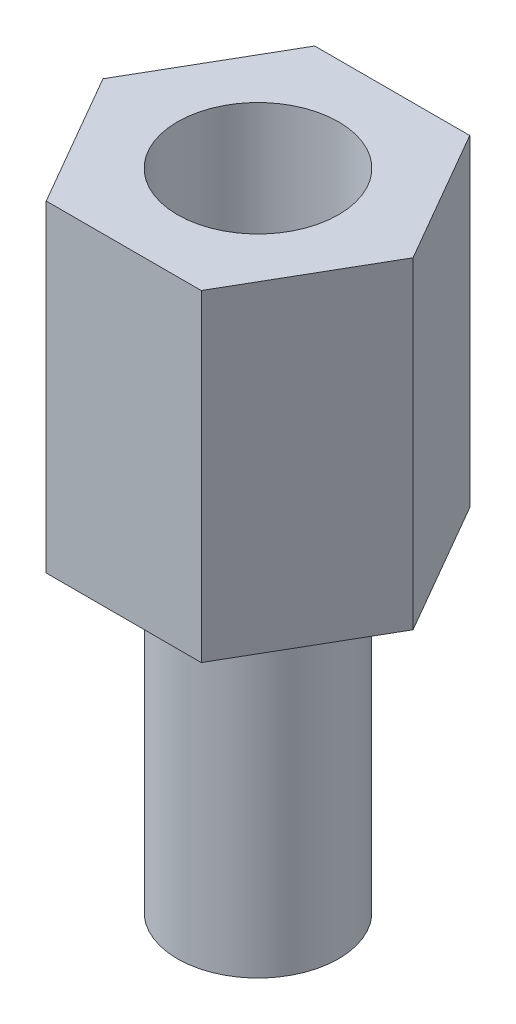
ISO-10303-21;
HEADER;
FILE_DESCRIPTION(('STEP AP214'),'2;1');
FILE_NAME('part.step','',(''),(''),'','','');
FILE_SCHEMA(('AUTOMOTIVE_DESIGN { 1 0 10303 214 1 1 1 1 }'));
ENDSEC;
DATA;
#1=APPLICATION_CONTEXT('core data for automotive mechanical design processes');
#2=APPLICATION_PROTOCOL_DEFINITION('international standard','automotive_design',2000,#1);
#3=PRODUCT_CONTEXT('',#1,'mechanical');
#4=PRODUCT('Part','Part','',(#3));
#5=PRODUCT_RELATED_PRODUCT_CATEGORY('part','',(#4));
#6=PRODUCT_DEFINITION_FORMATION('','',#4);
#7=PRODUCT_DEFINITION_CONTEXT('part definition',#1,'design');
#8=PRODUCT_DEFINITION('design','',#6,#7);
#9=PRODUCT_DEFINITION_SHAPE('','',#8);
#10=(LENGTH_UNIT() NAMED_UNIT(*) SI_UNIT(.MILLI.,.METRE.));
#11=(NAMED_UNIT(*) PLANE_ANGLE_UNIT() SI_UNIT($,.RADIAN.));
#12=(NAMED_UNIT(*) SI_UNIT($,.STERADIAN.) SOLID_ANGLE_UNIT());
#13=UNCERTAINTY_MEASURE_WITH_UNIT(LENGTH_MEASURE(1.E-05),#10,'distance_accuracy_value','');
#14=(GEOMETRIC_REPRESENTATION_CONTEXT(3) GLOBAL_UNCERTAINTY_ASSIGNED_CONTEXT((#13)) GLOBAL_UNIT_ASSIGNED_CONTEXT((#10,
#11,#12)) REPRESENTATION_CONTEXT('',''));
#15=CARTESIAN_POINT('',(0.,0.,0.));
#16=DIRECTION('',(0.,0.,1.));
#17=DIRECTION('',(1.,0.,0.));
#18=AXIS2_PLACEMENT_3D('',#15,#16,#17);
#19=CARTESIAN_POINT('',(0.,-6.,0.));
#20=DIRECTION('',(0.,1.,0.));
#21=DIRECTION('',(0.,0.,1.));
#22=AXIS2_PLACEMENT_3D('',#19,#20,#21);
#23=CYLINDRICAL_SURFACE('',#22,1.5);
#24=CARTESIAN_POINT('',(0.,-6.,0.));
#25=DIRECTION('',(0.,-1.,0.));
#26=DIRECTION('',(0.,0.,-1.));
#27=AXIS2_PLACEMENT_3D('',#24,#25,#26);
#28=CIRCLE('',#27,1.5);
#29=CARTESIAN_POINT('',(0.,-6.,-1.5));
#30=VERTEX_POINT('',#29);
#31=EDGE_CURVE('E11',#30,#30,#28,.T.);
#32=ORIENTED_EDGE('',*,*,#31,.F.);
#33=EDGE_LOOP('',(#32));
#34=FACE_BOUND('',#33,.T.);
#35=CARTESIAN_POINT('',(0.,0.,0.));
#36=DIRECTION('',(0.,-1.,0.));
#37=DIRECTION('',(0.,0.,-1.));
#38=AXIS2_PLACEMENT_3D('',#35,#36,#37);
#39=CIRCLE('',#38,1.5);
#40=CARTESIAN_POINT('',(0.,0.,-1.5));
#41=VERTEX_POINT('',#40);
#42=EDGE_CURVE('E44',#41,#41,#39,.T.);
#43=ORIENTED_EDGE('',*,*,#42,.T.);
#44=EDGE_LOOP('',(#43));
#45=FACE_BOUND('',#44,.T.);
#46=ADVANCED_FACE('F41',(#34,#45),#23,.T.);
#47=CARTESIAN_POINT('',(0.,-6.,0.));
#48=DIRECTION('',(0.,-1.,0.));
#49=DIRECTION('',(0.,0.,-1.));
#50=AXIS2_PLACEMENT_3D('',#47,#48,#49);
#51=PLANE('',#50);
#52=ORIENTED_EDGE('',*,*,#31,.T.);
#53=EDGE_LOOP('',(#52));
#54=FACE_BOUND('',#53,.T.);
#55=ADVANCED_FACE('F56',(#54),#51,.T.);
#56=CARTESIAN_POINT('',(0.,0.,0.));
#57=DIRECTION('',(0.,-1.,0.));
#58=DIRECTION('',(0.,0.,-1.));
#59=AXIS2_PLACEMENT_3D('',#56,#57,#58);
#60=PLANE('',#59);
#61=ORIENTED_EDGE('',*,*,#42,.F.);
#62=EDGE_LOOP('',(#61));
#63=FACE_BOUND('',#62,.T.);
#64=ADVANCED_FACE('F54',(#63),#60,.F.);
#65=CLOSED_SHELL('',(#46,#55,#64));
#66=MANIFOLD_SOLID_BREP('B2',#65);
#67=CARTESIAN_POINT('',(0.,6.,0.));
#68=DIRECTION('',(0.,1.,0.));
#69=DIRECTION('',(0.,0.,1.));
#70=AXIS2_PLACEMENT_3D('',#67,#68,#69);
#71=PLANE('',#70);
#72=DIRECTION('',(1.,0.,0.));
#73=VECTOR('',#72,1.);
#74=CARTESIAN_POINT('',(-1.44337567297405,6.,2.5));
#75=LINE('',#74,#73);
#76=CARTESIAN_POINT('',(-1.44337567297405,6.,2.5));
#77=VERTEX_POINT('',#76);
#78=CARTESIAN_POINT('',(1.44337567297408,6.,2.5));
#79=VERTEX_POINT('',#78);
#80=EDGE_CURVE('E178',#77,#79,#75,.T.);
#81=ORIENTED_EDGE('',*,*,#80,.T.);
#82=DIRECTION('',(0.500000000000001,0.,-0.866025403784438));
#83=VECTOR('',#82,1.);
#84=CARTESIAN_POINT('',(1.44337567297408,6.,2.5));
#85=LINE('',#84,#83);
#86=CARTESIAN_POINT('',(2.88675134594815,6.,0.));
#87=VERTEX_POINT('',#86);
#88=EDGE_CURVE('E136',#79,#87,#85,.T.);
#89=ORIENTED_EDGE('',*,*,#88,.T.);
#90=DIRECTION('',(-0.500000000000001,0.,-0.866025403784438));
#91=VECTOR('',#90,1.);
#92=CARTESIAN_POINT('',(2.88675134594815,6.,0.));
#93=LINE('',#92,#91);
#94=CARTESIAN_POINT('',(1.44337567297408,6.,-2.50000000000001));
#95=VERTEX_POINT('',#94);
#96=EDGE_CURVE('E149',#87,#95,#93,.T.);
#97=ORIENTED_EDGE('',*,*,#96,.T.);
#98=DIRECTION('',(-1.,0.,0.));
#99=VECTOR('',#98,1.);
#100=CARTESIAN_POINT('',(1.44337567297408,6.,-2.50000000000001));
#101=LINE('',#100,#99);
#102=CARTESIAN_POINT('',(-1.44337567297405,6.,-2.50000000000001));
#103=VERTEX_POINT('',#102);
#104=EDGE_CURVE('E143',#95,#103,#101,.T.);
#105=ORIENTED_EDGE('',*,*,#104,.T.);
#106=DIRECTION('',(-0.5,0.,0.866025403784438));
#107=VECTOR('',#106,1.);
#108=CARTESIAN_POINT('',(-1.44337567297405,6.,-2.50000000000001));
#109=LINE('',#108,#107);
#110=CARTESIAN_POINT('',(-2.88675134594812,6.,0.));
#111=VERTEX_POINT('',#110);
#112=EDGE_CURVE('E147',#103,#111,#109,.T.);
#113=ORIENTED_EDGE('',*,*,#112,.T.);
#114=DIRECTION('',(0.5,0.,0.866025403784438));
#115=VECTOR('',#114,1.);
#116=CARTESIAN_POINT('',(-2.88675134594812,6.,0.));
#117=LINE('',#116,#115);
#118=EDGE_CURVE('E99',#111,#77,#117,.T.);
#119=ORIENTED_EDGE('',*,*,#118,.T.);
#120=EDGE_LOOP('',(#81,#89,#97,#105,#113,#119));
#121=FACE_BOUND('',#120,.T.);
#122=CARTESIAN_POINT('',(0.,6.,0.));
#123=DIRECTION('',(0.,1.,0.));
#124=DIRECTION('',(0.,0.,1.));
#125=AXIS2_PLACEMENT_3D('',#122,#123,#124);
#126=CIRCLE('',#125,1.5);
#127=CARTESIAN_POINT('',(0.,6.,1.5));
#128=VERTEX_POINT('',#127);
#129=EDGE_CURVE('E171',#128,#128,#126,.T.);
#130=ORIENTED_EDGE('',*,*,#129,.F.);
#131=EDGE_LOOP('',(#130));
#132=FACE_BOUND('',#131,.T.);
#133=ADVANCED_FACE('F82',(#121,#132),#71,.T.);
#134=CARTESIAN_POINT('',(0.,0.,0.));
#135=DIRECTION('',(0.,1.,0.));
#136=DIRECTION('',(0.,0.,1.));
#137=AXIS2_PLACEMENT_3D('',#134,#135,#136);
#138=PLANE('',#137);
#139=DIRECTION('',(1.,0.,0.));
#140=VECTOR('',#139,1.);
#141=CARTESIAN_POINT('',(-1.44337567297405,0.,2.5));
#142=LINE('',#141,#140);
#143=CARTESIAN_POINT('',(-1.44337567297405,0.,2.5));
#144=VERTEX_POINT('',#143);
#145=CARTESIAN_POINT('',(1.44337567297408,0.,2.5));
#146=VERTEX_POINT('',#145);
#147=EDGE_CURVE('E167',#144,#146,#142,.T.);
#148=ORIENTED_EDGE('',*,*,#147,.F.);
#149=DIRECTION('',(0.5,0.,0.866025403784438));
#150=VECTOR('',#149,1.);
#151=CARTESIAN_POINT('',(-2.88675134594812,0.,0.));
#152=LINE('',#151,#150);
#153=CARTESIAN_POINT('',(-2.88675134594812,0.,0.));
#154=VERTEX_POINT('',#153);
#155=EDGE_CURVE('E128',#154,#144,#152,.T.);
#156=ORIENTED_EDGE('',*,*,#155,.F.);
#157=DIRECTION('',(-0.5,0.,0.866025403784438));
#158=VECTOR('',#157,1.);
#159=CARTESIAN_POINT('',(-1.44337567297405,0.,-2.50000000000001));
#160=LINE('',#159,#158);
#161=CARTESIAN_POINT('',(-1.44337567297405,0.,-2.50000000000001));
#162=VERTEX_POINT('',#161);
#163=EDGE_CURVE('E122',#162,#154,#160,.T.);
#164=ORIENTED_EDGE('',*,*,#163,.F.);
#165=DIRECTION('',(-1.,0.,0.));
#166=VECTOR('',#165,1.);
#167=CARTESIAN_POINT('',(1.44337567297408,0.,-2.50000000000001));
#168=LINE('',#167,#166);
#169=CARTESIAN_POINT('',(1.44337567297408,0.,-2.50000000000001));
#170=VERTEX_POINT('',#169);
#171=EDGE_CURVE('E157',#170,#162,#168,.T.);
#172=ORIENTED_EDGE('',*,*,#171,.F.);
#173=DIRECTION('',(-0.500000000000001,0.,-0.866025403784438));
#174=VECTOR('',#173,1.);
#175=CARTESIAN_POINT('',(2.88675134594815,0.,0.));
#176=LINE('',#175,#174);
#177=CARTESIAN_POINT('',(2.88675134594815,0.,0.));
#178=VERTEX_POINT('',#177);
#179=EDGE_CURVE('E173',#178,#170,#176,.T.);
#180=ORIENTED_EDGE('',*,*,#179,.F.);
#181=DIRECTION('',(0.500000000000001,0.,-0.866025403784438));
#182=VECTOR('',#181,1.);
#183=CARTESIAN_POINT('',(1.44337567297408,0.,2.5));
#184=LINE('',#183,#182);
#185=EDGE_CURVE('E170',#146,#178,#184,.T.);
#186=ORIENTED_EDGE('',*,*,#185,.F.);
#187=EDGE_LOOP('',(#148,#156,#164,#172,#180,#186));
#188=FACE_BOUND('',#187,.T.);
#189=CARTESIAN_POINT('',(0.,0.,0.));
#190=DIRECTION('',(0.,1.,0.));
#191=DIRECTION('',(0.,0.,1.));
#192=AXIS2_PLACEMENT_3D('',#189,#190,#191);
#193=CIRCLE('',#192,1.5);
#194=CARTESIAN_POINT('',(0.,0.,1.5));
#195=VERTEX_POINT('',#194);
#196=EDGE_CURVE('E271',#195,#195,#193,.T.);
#197=ORIENTED_EDGE('',*,*,#196,.T.);
#198=EDGE_LOOP('',(#197));
#199=FACE_BOUND('',#198,.T.);
#200=ADVANCED_FACE('F187',(#188,#199),#138,.F.);
#201=CARTESIAN_POINT('',(-1.44337567297405,6.,2.5));
#202=DIRECTION('',(0.,0.,-1.));
#203=DIRECTION('',(-1.,0.,0.));
#204=AXIS2_PLACEMENT_3D('',#201,#202,#203);
#205=PLANE('',#204);
#206=ORIENTED_EDGE('',*,*,#147,.T.);
#207=DIRECTION('',(0.,-1.,0.));
#208=VECTOR('',#207,1.);
#209=CARTESIAN_POINT('',(1.44337567297408,6.,2.5));
#210=LINE('',#209,#208);
#211=EDGE_CURVE('E39',#79,#146,#210,.T.);
#212=ORIENTED_EDGE('',*,*,#211,.F.);
#213=ORIENTED_EDGE('',*,*,#80,.F.);
#214=DIRECTION('',(0.,-1.,0.));
#215=VECTOR('',#214,1.);
#216=CARTESIAN_POINT('',(-1.44337567297405,6.,2.5));
#217=LINE('',#216,#215);
#218=EDGE_CURVE('E163',#77,#144,#217,.T.);
#219=ORIENTED_EDGE('',*,*,#218,.T.);
#220=EDGE_LOOP('',(#206,#212,#213,#219));
#221=FACE_BOUND('',#220,.T.);
#222=ADVANCED_FACE('F84',(#221),#205,.F.);
#223=CARTESIAN_POINT('',(1.44337567297408,6.,2.5));
#224=DIRECTION('',(-0.866025403784438,0.,-0.500000000000001));
#225=DIRECTION('',(-0.500000000000001,0.,0.866025403784438));
#226=AXIS2_PLACEMENT_3D('',#223,#224,#225);
#227=PLANE('',#226);
#228=ORIENTED_EDGE('',*,*,#185,.T.);
#229=DIRECTION('',(0.,-1.,0.));
#230=VECTOR('',#229,1.);
#231=CARTESIAN_POINT('',(2.88675134594815,6.,0.));
#232=LINE('',#231,#230);
#233=EDGE_CURVE('E91',#87,#178,#232,.T.);
#234=ORIENTED_EDGE('',*,*,#233,.F.);
#235=ORIENTED_EDGE('',*,*,#88,.F.);
#236=ORIENTED_EDGE('',*,*,#211,.T.);
#237=EDGE_LOOP('',(#228,#234,#235,#236));
#238=FACE_BOUND('',#237,.T.);
#239=ADVANCED_FACE('F212',(#238),#227,.F.);
#240=CARTESIAN_POINT('',(2.88675134594815,6.,0.));
#241=DIRECTION('',(-0.866025403784438,0.,0.500000000000001));
#242=DIRECTION('',(0.500000000000001,0.,0.866025403784438));
#243=AXIS2_PLACEMENT_3D('',#240,#241,#242);
#244=PLANE('',#243);
#245=ORIENTED_EDGE('',*,*,#179,.T.);
#246=DIRECTION('',(0.,-1.,0.));
#247=VECTOR('',#246,1.);
#248=CARTESIAN_POINT('',(1.44337567297408,6.,-2.50000000000001));
#249=LINE('',#248,#247);
#250=EDGE_CURVE('E158',#95,#170,#249,.T.);
#251=ORIENTED_EDGE('',*,*,#250,.F.);
#252=ORIENTED_EDGE('',*,*,#96,.F.);
#253=ORIENTED_EDGE('',*,*,#233,.T.);
#254=EDGE_LOOP('',(#245,#251,#252,#253));
#255=FACE_BOUND('',#254,.T.);
#256=ADVANCED_FACE('F184',(#255),#244,.F.);
#257=CARTESIAN_POINT('',(1.44337567297408,6.,-2.50000000000001));
#258=DIRECTION('',(0.,0.,1.));
#259=DIRECTION('',(1.,0.,0.));
#260=AXIS2_PLACEMENT_3D('',#257,#258,#259);
#261=PLANE('',#260);
#262=ORIENTED_EDGE('',*,*,#171,.T.);
#263=DIRECTION('',(0.,-1.,0.));
#264=VECTOR('',#263,1.);
#265=CARTESIAN_POINT('',(-1.44337567297405,6.,-2.50000000000001));
#266=LINE('',#265,#264);
#267=EDGE_CURVE('E154',#103,#162,#266,.T.);
#268=ORIENTED_EDGE('',*,*,#267,.F.);
#269=ORIENTED_EDGE('',*,*,#104,.F.);
#270=ORIENTED_EDGE('',*,*,#250,.T.);
#271=EDGE_LOOP('',(#262,#268,#269,#270));
#272=FACE_BOUND('',#271,.T.);
#273=ADVANCED_FACE('F155',(#272),#261,.F.);
#274=CARTESIAN_POINT('',(-1.44337567297405,6.,-2.50000000000001));
#275=DIRECTION('',(0.866025403784439,0.,0.5));
#276=DIRECTION('',(0.5,0.,-0.866025403784439));
#277=AXIS2_PLACEMENT_3D('',#274,#275,#276);
#278=PLANE('',#277);
#279=ORIENTED_EDGE('',*,*,#163,.T.);
#280=DIRECTION('',(0.,-1.,0.));
#281=VECTOR('',#280,1.);
#282=CARTESIAN_POINT('',(-2.88675134594812,6.,0.));
#283=LINE('',#282,#281);
#284=EDGE_CURVE('E159',#111,#154,#283,.T.);
#285=ORIENTED_EDGE('',*,*,#284,.F.);
#286=ORIENTED_EDGE('',*,*,#112,.F.);
#287=ORIENTED_EDGE('',*,*,#267,.T.);
#288=EDGE_LOOP('',(#279,#285,#286,#287));
#289=FACE_BOUND('',#288,.T.);
#290=ADVANCED_FACE('F161',(#289),#278,.F.);
#291=CARTESIAN_POINT('',(-2.88675134594812,6.,0.));
#292=DIRECTION('',(0.866025403784438,0.,-0.500000000000001));
#293=DIRECTION('',(-0.500000000000001,0.,-0.866025403784438));
#294=AXIS2_PLACEMENT_3D('',#291,#292,#293);
#295=PLANE('',#294);
#296=ORIENTED_EDGE('',*,*,#155,.T.);
#297=ORIENTED_EDGE('',*,*,#218,.F.);
#298=ORIENTED_EDGE('',*,*,#118,.F.);
#299=ORIENTED_EDGE('',*,*,#284,.T.);
#300=EDGE_LOOP('',(#296,#297,#298,#299));
#301=FACE_BOUND('',#300,.T.);
#302=ADVANCED_FACE('F192',(#301),#295,.F.);
#303=CARTESIAN_POINT('',(0.,6.,0.));
#304=DIRECTION('',(0.,-1.,0.));
#305=DIRECTION('',(0.,0.,-1.));
#306=AXIS2_PLACEMENT_3D('',#303,#304,#305);
#307=CYLINDRICAL_SURFACE('',#306,1.5);
#308=ORIENTED_EDGE('',*,*,#129,.T.);
#309=EDGE_LOOP('',(#308));
#310=FACE_BOUND('',#309,.T.);
#311=ORIENTED_EDGE('',*,*,#196,.F.);
#312=EDGE_LOOP('',(#311));
#313=FACE_BOUND('',#312,.T.);
#314=ADVANCED_FACE('F194',(#310,#313),#307,.F.);
#315=CLOSED_SHELL('',(#133,#200,#222,#239,#256,#273,#290,#302,#314));
#316=MANIFOLD_SOLID_BREP('B6',#315);
#317=ADVANCED_BREP_SHAPE_REPRESENTATION('',(#18,#66,#316),#14);
#318=SHAPE_DEFINITION_REPRESENTATION(#9,#317);
ENDSEC;
END-ISO-10303-21;
